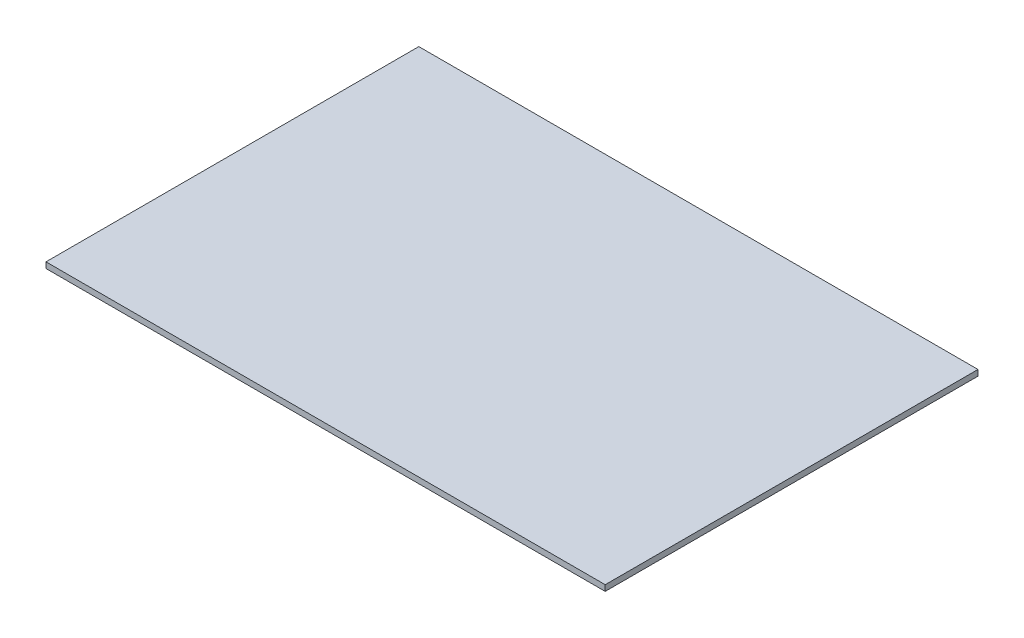
ISO-10303-21;
HEADER;
FILE_DESCRIPTION(('STEP AP214'),'2;1');
FILE_NAME('part.step','',(''),(''),'','','');
FILE_SCHEMA(('AUTOMOTIVE_DESIGN { 1 0 10303 214 1 1 1 1 }'));
ENDSEC;
DATA;
#1=APPLICATION_CONTEXT('core data for automotive mechanical design processes');
#2=APPLICATION_PROTOCOL_DEFINITION('international standard','automotive_design',2000,#1);
#3=PRODUCT_CONTEXT('',#1,'mechanical');
#4=PRODUCT('Part','Part','',(#3));
#5=PRODUCT_RELATED_PRODUCT_CATEGORY('part','',(#4));
#6=PRODUCT_DEFINITION_FORMATION('','',#4);
#7=PRODUCT_DEFINITION_CONTEXT('part definition',#1,'design');
#8=PRODUCT_DEFINITION('design','',#6,#7);
#9=PRODUCT_DEFINITION_SHAPE('','',#8);
#10=(LENGTH_UNIT() NAMED_UNIT(*) SI_UNIT(.MILLI.,.METRE.));
#11=(NAMED_UNIT(*) PLANE_ANGLE_UNIT() SI_UNIT($,.RADIAN.));
#12=(NAMED_UNIT(*) SI_UNIT($,.STERADIAN.) SOLID_ANGLE_UNIT());
#13=UNCERTAINTY_MEASURE_WITH_UNIT(LENGTH_MEASURE(1.E-05),#10,'distance_accuracy_value','');
#14=(GEOMETRIC_REPRESENTATION_CONTEXT(3) GLOBAL_UNCERTAINTY_ASSIGNED_CONTEXT((#13)) GLOBAL_UNIT_ASSIGNED_CONTEXT((#10,
#11,#12)) REPRESENTATION_CONTEXT('',''));
#15=CARTESIAN_POINT('',(0.,0.,0.));
#16=DIRECTION('',(0.,0.,1.));
#17=DIRECTION('',(1.,0.,0.));
#18=AXIS2_PLACEMENT_3D('',#15,#16,#17);
#19=CARTESIAN_POINT('',(-152.4,3.175,101.6));
#20=DIRECTION('',(1.,0.,0.));
#21=DIRECTION('',(0.,0.,-1.));
#22=AXIS2_PLACEMENT_3D('',#19,#20,#21);
#23=PLANE('',#22);
#24=DIRECTION('',(0.,0.,1.));
#25=VECTOR('',#24,1.);
#26=CARTESIAN_POINT('',(-152.4,0.,101.6));
#27=LINE('',#26,#25);
#28=CARTESIAN_POINT('',(-152.4,0.,-101.6));
#29=VERTEX_POINT('',#28);
#30=CARTESIAN_POINT('',(-152.4,0.,101.6));
#31=VERTEX_POINT('',#30);
#32=EDGE_CURVE('E100',#29,#31,#27,.T.);
#33=ORIENTED_EDGE('',*,*,#32,.T.);
#34=DIRECTION('',(0.,-1.,0.));
#35=VECTOR('',#34,1.);
#36=CARTESIAN_POINT('',(-152.4,3.175,101.6));
#37=LINE('',#36,#35);
#38=CARTESIAN_POINT('',(-152.4,3.175,101.6));
#39=VERTEX_POINT('',#38);
#40=EDGE_CURVE('E11',#39,#31,#37,.T.);
#41=ORIENTED_EDGE('',*,*,#40,.F.);
#42=DIRECTION('',(0.,0.,1.));
#43=VECTOR('',#42,1.);
#44=CARTESIAN_POINT('',(-152.4,3.175,101.6));
#45=LINE('',#44,#43);
#46=CARTESIAN_POINT('',(-152.4,3.175,-101.6));
#47=VERTEX_POINT('',#46);
#48=EDGE_CURVE('E88',#47,#39,#45,.T.);
#49=ORIENTED_EDGE('',*,*,#48,.F.);
#50=DIRECTION('',(0.,-1.,0.));
#51=VECTOR('',#50,1.);
#52=CARTESIAN_POINT('',(-152.4,3.175,-101.6));
#53=LINE('',#52,#51);
#54=EDGE_CURVE('E96',#47,#29,#53,.T.);
#55=ORIENTED_EDGE('',*,*,#54,.T.);
#56=EDGE_LOOP('',(#33,#41,#49,#55));
#57=FACE_BOUND('',#56,.T.);
#58=ADVANCED_FACE('F37',(#57),#23,.F.);
#59=CARTESIAN_POINT('',(152.4,3.175,101.6));
#60=DIRECTION('',(0.,0.,-1.));
#61=DIRECTION('',(-1.,0.,0.));
#62=AXIS2_PLACEMENT_3D('',#59,#60,#61);
#63=PLANE('',#62);
#64=DIRECTION('',(1.,0.,0.));
#65=VECTOR('',#64,1.);
#66=CARTESIAN_POINT('',(152.4,0.,101.6));
#67=LINE('',#66,#65);
#68=CARTESIAN_POINT('',(152.4,0.,101.6));
#69=VERTEX_POINT('',#68);
#70=EDGE_CURVE('E92',#31,#69,#67,.T.);
#71=ORIENTED_EDGE('',*,*,#70,.T.);
#72=DIRECTION('',(0.,-1.,0.));
#73=VECTOR('',#72,1.);
#74=CARTESIAN_POINT('',(152.4,3.175,101.6));
#75=LINE('',#74,#73);
#76=CARTESIAN_POINT('',(152.4,3.175,101.6));
#77=VERTEX_POINT('',#76);
#78=EDGE_CURVE('E45',#77,#69,#75,.T.);
#79=ORIENTED_EDGE('',*,*,#78,.F.);
#80=DIRECTION('',(1.,0.,0.));
#81=VECTOR('',#80,1.);
#82=CARTESIAN_POINT('',(152.4,3.175,101.6));
#83=LINE('',#82,#81);
#84=EDGE_CURVE('E83',#39,#77,#83,.T.);
#85=ORIENTED_EDGE('',*,*,#84,.F.);
#86=ORIENTED_EDGE('',*,*,#40,.T.);
#87=EDGE_LOOP('',(#71,#79,#85,#86));
#88=FACE_BOUND('',#87,.T.);
#89=ADVANCED_FACE('F91',(#88),#63,.F.);
#90=CARTESIAN_POINT('',(152.4,3.175,101.6));
#91=DIRECTION('',(-1.,0.,0.));
#92=DIRECTION('',(0.,0.,1.));
#93=AXIS2_PLACEMENT_3D('',#90,#91,#92);
#94=PLANE('',#93);
#95=DIRECTION('',(0.,0.,-1.));
#96=VECTOR('',#95,1.);
#97=CARTESIAN_POINT('',(152.4,0.,101.6));
#98=LINE('',#97,#96);
#99=CARTESIAN_POINT('',(152.4,0.,-101.6));
#100=VERTEX_POINT('',#99);
#101=EDGE_CURVE('E70',#69,#100,#98,.T.);
#102=ORIENTED_EDGE('',*,*,#101,.T.);
#103=DIRECTION('',(0.,-1.,0.));
#104=VECTOR('',#103,1.);
#105=CARTESIAN_POINT('',(152.4,3.175,-101.6));
#106=LINE('',#105,#104);
#107=CARTESIAN_POINT('',(152.4,3.175,-101.6));
#108=VERTEX_POINT('',#107);
#109=EDGE_CURVE('E93',#108,#100,#106,.T.);
#110=ORIENTED_EDGE('',*,*,#109,.F.);
#111=DIRECTION('',(0.,0.,-1.));
#112=VECTOR('',#111,1.);
#113=CARTESIAN_POINT('',(152.4,3.175,101.6));
#114=LINE('',#113,#112);
#115=EDGE_CURVE('E86',#77,#108,#114,.T.);
#116=ORIENTED_EDGE('',*,*,#115,.F.);
#117=ORIENTED_EDGE('',*,*,#78,.T.);
#118=EDGE_LOOP('',(#102,#110,#116,#117));
#119=FACE_BOUND('',#118,.T.);
#120=ADVANCED_FACE('F94',(#119),#94,.F.);
#121=CARTESIAN_POINT('',(152.4,3.175,-101.6));
#122=DIRECTION('',(0.,0.,1.));
#123=DIRECTION('',(1.,0.,0.));
#124=AXIS2_PLACEMENT_3D('',#121,#122,#123);
#125=PLANE('',#124);
#126=DIRECTION('',(-1.,0.,0.));
#127=VECTOR('',#126,1.);
#128=CARTESIAN_POINT('',(152.4,0.,-101.6));
#129=LINE('',#128,#127);
#130=EDGE_CURVE('E76',#100,#29,#129,.T.);
#131=ORIENTED_EDGE('',*,*,#130,.T.);
#132=ORIENTED_EDGE('',*,*,#54,.F.);
#133=DIRECTION('',(-1.,0.,0.));
#134=VECTOR('',#133,1.);
#135=CARTESIAN_POINT('',(152.4,3.175,-101.6));
#136=LINE('',#135,#134);
#137=EDGE_CURVE('E53',#108,#47,#136,.T.);
#138=ORIENTED_EDGE('',*,*,#137,.F.);
#139=ORIENTED_EDGE('',*,*,#109,.T.);
#140=EDGE_LOOP('',(#131,#132,#138,#139));
#141=FACE_BOUND('',#140,.T.);
#142=ADVANCED_FACE('F107',(#141),#125,.F.);
#143=CARTESIAN_POINT('',(0.,3.175,0.));
#144=DIRECTION('',(0.,1.,0.));
#145=DIRECTION('',(0.,0.,1.));
#146=AXIS2_PLACEMENT_3D('',#143,#144,#145);
#147=PLANE('',#146);
#148=ORIENTED_EDGE('',*,*,#48,.T.);
#149=ORIENTED_EDGE('',*,*,#84,.T.);
#150=ORIENTED_EDGE('',*,*,#115,.T.);
#151=ORIENTED_EDGE('',*,*,#137,.T.);
#152=EDGE_LOOP('',(#148,#149,#150,#151));
#153=FACE_BOUND('',#152,.T.);
#154=ADVANCED_FACE('F84',(#153),#147,.T.);
#155=CARTESIAN_POINT('',(0.,0.,0.));
#156=DIRECTION('',(0.,1.,0.));
#157=DIRECTION('',(0.,0.,1.));
#158=AXIS2_PLACEMENT_3D('',#155,#156,#157);
#159=PLANE('',#158);
#160=ORIENTED_EDGE('',*,*,#32,.F.);
#161=ORIENTED_EDGE('',*,*,#130,.F.);
#162=ORIENTED_EDGE('',*,*,#101,.F.);
#163=ORIENTED_EDGE('',*,*,#70,.F.);
#164=EDGE_LOOP('',(#160,#161,#162,#163));
#165=FACE_BOUND('',#164,.T.);
#166=ADVANCED_FACE('F110',(#165),#159,.F.);
#167=CLOSED_SHELL('',(#58,#89,#120,#142,#154,#166));
#168=MANIFOLD_SOLID_BREP('B2',#167);
#169=ADVANCED_BREP_SHAPE_REPRESENTATION('',(#18,#168),#14);
#170=SHAPE_DEFINITION_REPRESENTATION(#9,#169);
ENDSEC;
END-ISO-10303-21;
